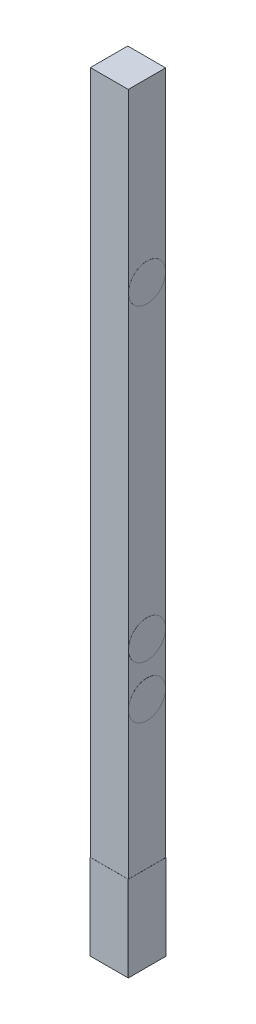
ISO-10303-21;
HEADER;
FILE_DESCRIPTION(('STEP AP214'),'2;1');
FILE_NAME('part.step','',(''),(''),'','','');
FILE_SCHEMA(('AUTOMOTIVE_DESIGN { 1 0 10303 214 1 1 1 1 }'));
ENDSEC;
DATA;
#1=APPLICATION_CONTEXT('core data for automotive mechanical design processes');
#2=APPLICATION_PROTOCOL_DEFINITION('international standard','automotive_design',2000,#1);
#3=PRODUCT_CONTEXT('',#1,'mechanical');
#4=PRODUCT('Part','Part','',(#3));
#5=PRODUCT_RELATED_PRODUCT_CATEGORY('part','',(#4));
#6=PRODUCT_DEFINITION_FORMATION('','',#4);
#7=PRODUCT_DEFINITION_CONTEXT('part definition',#1,'design');
#8=PRODUCT_DEFINITION('design','',#6,#7);
#9=PRODUCT_DEFINITION_SHAPE('','',#8);
#10=(LENGTH_UNIT() NAMED_UNIT(*) SI_UNIT(.MILLI.,.METRE.));
#11=(NAMED_UNIT(*) PLANE_ANGLE_UNIT() SI_UNIT($,.RADIAN.));
#12=(NAMED_UNIT(*) SI_UNIT($,.STERADIAN.) SOLID_ANGLE_UNIT());
#13=UNCERTAINTY_MEASURE_WITH_UNIT(LENGTH_MEASURE(1.E-05),#10,'distance_accuracy_value','');
#14=(GEOMETRIC_REPRESENTATION_CONTEXT(3) GLOBAL_UNCERTAINTY_ASSIGNED_CONTEXT((#13)) GLOBAL_UNIT_ASSIGNED_CONTEXT((#10,
#11,#12)) REPRESENTATION_CONTEXT('',''));
#15=CARTESIAN_POINT('',(0.,0.,0.));
#16=DIRECTION('',(0.,0.,1.));
#17=DIRECTION('',(1.,0.,0.));
#18=AXIS2_PLACEMENT_3D('',#15,#16,#17);
#19=CARTESIAN_POINT('',(-22.51,914.4,22.1884285714286));
#20=DIRECTION('',(0.,0.,-1.));
#21=DIRECTION('',(-1.,0.,0.));
#22=AXIS2_PLACEMENT_3D('',#19,#20,#21);
#23=PLANE('',#22);
#24=DIRECTION('',(-1.,0.,0.));
#25=VECTOR('',#24,1.);
#26=CARTESIAN_POINT('',(-22.61,101.6,22.1884285714286));
#27=LINE('',#26,#25);
#28=CARTESIAN_POINT('',(22.51,101.6,22.1884285714286));
#29=VERTEX_POINT('',#28);
#30=CARTESIAN_POINT('',(-22.51,101.6,22.1884285714286));
#31=VERTEX_POINT('',#30);
#32=EDGE_CURVE('E146',#29,#31,#27,.T.);
#33=ORIENTED_EDGE('',*,*,#32,.F.);
#34=DIRECTION('',(0.,-1.,0.));
#35=VECTOR('',#34,1.);
#36=CARTESIAN_POINT('',(22.51,914.4,22.1884285714286));
#37=LINE('',#36,#35);
#38=CARTESIAN_POINT('',(22.51,914.4,22.1884285714286));
#39=VERTEX_POINT('',#38);
#40=EDGE_CURVE('E226',#39,#29,#37,.T.);
#41=ORIENTED_EDGE('',*,*,#40,.F.);
#42=DIRECTION('',(1.,0.,0.));
#43=VECTOR('',#42,1.);
#44=CARTESIAN_POINT('',(-22.51,914.4,22.1884285714286));
#45=LINE('',#44,#43);
#46=CARTESIAN_POINT('',(-22.51,914.4,22.1884285714286));
#47=VERTEX_POINT('',#46);
#48=EDGE_CURVE('E223',#47,#39,#45,.T.);
#49=ORIENTED_EDGE('',*,*,#48,.F.);
#50=DIRECTION('',(0.,-1.,0.));
#51=VECTOR('',#50,1.);
#52=CARTESIAN_POINT('',(-22.51,914.4,22.1884285714286));
#53=LINE('',#52,#51);
#54=EDGE_CURVE('E232',#47,#31,#53,.T.);
#55=ORIENTED_EDGE('',*,*,#54,.T.);
#56=EDGE_LOOP('',(#33,#41,#49,#55));
#57=FACE_BOUND('',#56,.T.);
#58=ADVANCED_FACE('F41',(#57),#23,.F.);
#59=DIRECTION('',(0.,1.,0.));
#60=VECTOR('',#59,1.);
#61=CARTESIAN_POINT('',(22.51,0.,22.1884285714286));
#62=LINE('',#61,#60);
#63=CARTESIAN_POINT('',(22.51,0.,22.1884285714286));
#64=VERTEX_POINT('',#63);
#65=EDGE_CURVE('E57',#64,#29,#62,.T.);
#66=ORIENTED_EDGE('',*,*,#65,.F.);
#67=DIRECTION('',(1.,0.,0.));
#68=VECTOR('',#67,1.);
#69=CARTESIAN_POINT('',(-22.51,0.,22.1884285714286));
#70=LINE('',#69,#68);
#71=CARTESIAN_POINT('',(22.61,0.,22.1884285714286));
#72=VERTEX_POINT('',#71);
#73=EDGE_CURVE('E212',#64,#72,#70,.T.);
#74=ORIENTED_EDGE('',*,*,#73,.T.);
#75=DIRECTION('',(0.,-1.,0.));
#76=VECTOR('',#75,1.);
#77=CARTESIAN_POINT('',(22.61,0.,22.1884285714286));
#78=LINE('',#77,#76);
#79=CARTESIAN_POINT('',(22.61,101.6,22.1884285714286));
#80=VERTEX_POINT('',#79);
#81=EDGE_CURVE('E185',#80,#72,#78,.T.);
#82=ORIENTED_EDGE('',*,*,#81,.F.);
#83=DIRECTION('',(-1.,0.,0.));
#84=VECTOR('',#83,1.);
#85=CARTESIAN_POINT('',(22.61,101.6,22.1884285714286));
#86=LINE('',#85,#84);
#87=EDGE_CURVE('E195',#80,#29,#86,.T.);
#88=ORIENTED_EDGE('',*,*,#87,.T.);
#89=EDGE_LOOP('',(#66,#74,#82,#88));
#90=FACE_BOUND('',#89,.T.);
#91=ADVANCED_FACE('F283',(#90),#23,.F.);
#92=CARTESIAN_POINT('',(-22.51,914.4,22.1884285714286));
#93=DIRECTION('',(1.,0.,0.));
#94=DIRECTION('',(0.,0.,-1.));
#95=AXIS2_PLACEMENT_3D('',#92,#93,#94);
#96=PLANE('',#95);
#97=DIRECTION('',(0.,0.,-1.));
#98=VECTOR('',#97,1.);
#99=CARTESIAN_POINT('',(-22.51,101.6,-22.2884285714286));
#100=LINE('',#99,#98);
#101=CARTESIAN_POINT('',(-22.51,101.6,-22.1884285714286));
#102=VERTEX_POINT('',#101);
#103=EDGE_CURVE('E164',#31,#102,#100,.T.);
#104=ORIENTED_EDGE('',*,*,#103,.F.);
#105=ORIENTED_EDGE('',*,*,#54,.F.);
#106=DIRECTION('',(0.,0.,1.));
#107=VECTOR('',#106,1.);
#108=CARTESIAN_POINT('',(-22.51,914.4,22.1884285714286));
#109=LINE('',#108,#107);
#110=CARTESIAN_POINT('',(-22.51,914.4,-22.1884285714286));
#111=VERTEX_POINT('',#110);
#112=EDGE_CURVE('E220',#111,#47,#109,.T.);
#113=ORIENTED_EDGE('',*,*,#112,.F.);
#114=DIRECTION('',(0.,-1.,0.));
#115=VECTOR('',#114,1.);
#116=CARTESIAN_POINT('',(-22.51,914.4,-22.1884285714286));
#117=LINE('',#116,#115);
#118=EDGE_CURVE('E236',#111,#102,#117,.T.);
#119=ORIENTED_EDGE('',*,*,#118,.T.);
#120=EDGE_LOOP('',(#104,#105,#113,#119));
#121=FACE_BOUND('',#120,.T.);
#122=ADVANCED_FACE('F285',(#121),#96,.F.);
#123=CARTESIAN_POINT('',(-22.51,914.4,-22.1884285714286));
#124=DIRECTION('',(0.,0.,1.));
#125=DIRECTION('',(1.,0.,0.));
#126=AXIS2_PLACEMENT_3D('',#123,#124,#125);
#127=PLANE('',#126);
#128=DIRECTION('',(1.,0.,0.));
#129=VECTOR('',#128,1.);
#130=CARTESIAN_POINT('',(22.61,101.6,-22.1884285714286));
#131=LINE('',#130,#129);
#132=CARTESIAN_POINT('',(22.51,101.6,-22.1884285714286));
#133=VERTEX_POINT('',#132);
#134=EDGE_CURVE('E65',#102,#133,#131,.T.);
#135=ORIENTED_EDGE('',*,*,#134,.F.);
#136=ORIENTED_EDGE('',*,*,#118,.F.);
#137=DIRECTION('',(-1.,0.,0.));
#138=VECTOR('',#137,1.);
#139=CARTESIAN_POINT('',(-22.51,914.4,-22.1884285714286));
#140=LINE('',#139,#138);
#141=CARTESIAN_POINT('',(22.51,914.4,-22.1884285714286));
#142=VERTEX_POINT('',#141);
#143=EDGE_CURVE('E217',#142,#111,#140,.T.);
#144=ORIENTED_EDGE('',*,*,#143,.F.);
#145=DIRECTION('',(0.,-1.,0.));
#146=VECTOR('',#145,1.);
#147=CARTESIAN_POINT('',(22.51,914.4,-22.1884285714286));
#148=LINE('',#147,#146);
#149=EDGE_CURVE('E240',#142,#133,#148,.T.);
#150=ORIENTED_EDGE('',*,*,#149,.T.);
#151=EDGE_LOOP('',(#135,#136,#144,#150));
#152=FACE_BOUND('',#151,.T.);
#153=ADVANCED_FACE('F256',(#152),#127,.F.);
#154=CARTESIAN_POINT('',(22.51,914.4,22.1884285714286));
#155=DIRECTION('',(-1.,0.,0.));
#156=DIRECTION('',(0.,0.,1.));
#157=AXIS2_PLACEMENT_3D('',#154,#155,#156);
#158=PLANE('',#157);
#159=CARTESIAN_POINT('',(22.51,337.8,0.));
#160=DIRECTION('',(-1.,0.,0.));
#161=DIRECTION('',(0.,0.,1.));
#162=AXIS2_PLACEMENT_3D('',#159,#160,#161);
#163=CIRCLE('',#162,22.);
#164=CARTESIAN_POINT('',(22.51,337.8,22.));
#165=VERTEX_POINT('',#164);
#166=EDGE_CURVE('E244',#165,#165,#163,.F.);
#167=ORIENTED_EDGE('',*,*,#166,.F.);
#168=EDGE_LOOP('',(#167));
#169=FACE_BOUND('',#168,.T.);
#170=CARTESIAN_POINT('',(22.51,275.7,0.));
#171=DIRECTION('',(-1.,0.,0.));
#172=DIRECTION('',(0.,0.,1.));
#173=AXIS2_PLACEMENT_3D('',#170,#171,#172);
#174=CIRCLE('',#173,22.);
#175=CARTESIAN_POINT('',(22.51,275.7,22.));
#176=VERTEX_POINT('',#175);
#177=EDGE_CURVE('E50',#176,#176,#174,.F.);
#178=ORIENTED_EDGE('',*,*,#177,.F.);
#179=EDGE_LOOP('',(#178));
#180=FACE_BOUND('',#179,.T.);
#181=CARTESIAN_POINT('',(22.51,704.8,0.));
#182=DIRECTION('',(-1.,0.,0.));
#183=DIRECTION('',(0.,0.,1.));
#184=AXIS2_PLACEMENT_3D('',#181,#182,#183);
#185=CIRCLE('',#184,22.);
#186=CARTESIAN_POINT('',(22.51,704.8,22.));
#187=VERTEX_POINT('',#186);
#188=EDGE_CURVE('E11',#187,#187,#185,.F.);
#189=ORIENTED_EDGE('',*,*,#188,.F.);
#190=EDGE_LOOP('',(#189));
#191=FACE_BOUND('',#190,.T.);
#192=DIRECTION('',(0.,0.,1.));
#193=VECTOR('',#192,1.);
#194=CARTESIAN_POINT('',(22.51,101.6,22.1884285714286));
#195=LINE('',#194,#193);
#196=EDGE_CURVE('E182',#133,#29,#195,.T.);
#197=ORIENTED_EDGE('',*,*,#196,.F.);
#198=ORIENTED_EDGE('',*,*,#149,.F.);
#199=DIRECTION('',(0.,0.,-1.));
#200=VECTOR('',#199,1.);
#201=CARTESIAN_POINT('',(22.51,914.4,22.1884285714286));
#202=LINE('',#201,#200);
#203=EDGE_CURVE('E213',#39,#142,#202,.T.);
#204=ORIENTED_EDGE('',*,*,#203,.F.);
#205=ORIENTED_EDGE('',*,*,#40,.T.);
#206=EDGE_LOOP('',(#197,#198,#204,#205));
#207=FACE_BOUND('',#206,.T.);
#208=ADVANCED_FACE('F43',(#169,#180,#191,#207),#158,.F.);
#209=CARTESIAN_POINT('',(0.,914.4,0.));
#210=DIRECTION('',(0.,-1.,0.));
#211=DIRECTION('',(0.,0.,-1.));
#212=AXIS2_PLACEMENT_3D('',#209,#210,#211);
#213=PLANE('',#212);
#214=ORIENTED_EDGE('',*,*,#203,.T.);
#215=ORIENTED_EDGE('',*,*,#143,.T.);
#216=ORIENTED_EDGE('',*,*,#112,.T.);
#217=ORIENTED_EDGE('',*,*,#48,.T.);
#218=EDGE_LOOP('',(#214,#215,#216,#217));
#219=FACE_BOUND('',#218,.T.);
#220=ADVANCED_FACE('F255',(#219),#213,.F.);
#221=CARTESIAN_POINT('',(0.,0.,0.));
#222=DIRECTION('',(0.,-1.,0.));
#223=DIRECTION('',(0.,0.,-1.));
#224=AXIS2_PLACEMENT_3D('',#221,#222,#223);
#225=PLANE('',#224);
#226=ORIENTED_EDGE('',*,*,#73,.F.);
#227=DIRECTION('',(0.,0.,-1.));
#228=VECTOR('',#227,1.);
#229=CARTESIAN_POINT('',(22.51,0.,22.2884285714286));
#230=LINE('',#229,#228);
#231=CARTESIAN_POINT('',(22.51,0.,22.2884285714286));
#232=VERTEX_POINT('',#231);
#233=EDGE_CURVE('E135',#232,#64,#230,.T.);
#234=ORIENTED_EDGE('',*,*,#233,.F.);
#235=DIRECTION('',(1.,0.,0.));
#236=VECTOR('',#235,1.);
#237=CARTESIAN_POINT('',(-22.61,0.,22.2884285714286));
#238=LINE('',#237,#236);
#239=CARTESIAN_POINT('',(-22.61,0.,22.2884285714286));
#240=VERTEX_POINT('',#239);
#241=EDGE_CURVE('E132',#240,#232,#238,.T.);
#242=ORIENTED_EDGE('',*,*,#241,.F.);
#243=DIRECTION('',(0.,0.,1.));
#244=VECTOR('',#243,1.);
#245=CARTESIAN_POINT('',(-22.61,0.,-22.2884285714286));
#246=LINE('',#245,#244);
#247=CARTESIAN_POINT('',(-22.61,0.,-22.2884285714286));
#248=VERTEX_POINT('',#247);
#249=EDGE_CURVE('E118',#248,#240,#246,.T.);
#250=ORIENTED_EDGE('',*,*,#249,.F.);
#251=DIRECTION('',(-1.,0.,0.));
#252=VECTOR('',#251,1.);
#253=CARTESIAN_POINT('',(22.61,0.,-22.2884285714286));
#254=LINE('',#253,#252);
#255=CARTESIAN_POINT('',(22.61,0.,-22.2884285714286));
#256=VERTEX_POINT('',#255);
#257=EDGE_CURVE('E175',#256,#248,#254,.T.);
#258=ORIENTED_EDGE('',*,*,#257,.F.);
#259=DIRECTION('',(0.,0.,-1.));
#260=VECTOR('',#259,1.);
#261=CARTESIAN_POINT('',(22.61,0.,22.1884285714286));
#262=LINE('',#261,#260);
#263=EDGE_CURVE('E189',#72,#256,#262,.T.);
#264=ORIENTED_EDGE('',*,*,#263,.F.);
#265=EDGE_LOOP('',(#226,#234,#242,#250,#258,#264));
#266=FACE_BOUND('',#265,.T.);
#267=ADVANCED_FACE('F133',(#266),#225,.T.);
#268=CARTESIAN_POINT('',(22.61,337.8,0.));
#269=DIRECTION('',(-1.,0.,0.));
#270=DIRECTION('',(0.,0.,1.));
#271=AXIS2_PLACEMENT_3D('',#268,#269,#270);
#272=CYLINDRICAL_SURFACE('',#271,22.);
#273=CARTESIAN_POINT('',(22.61,337.8,0.));
#274=DIRECTION('',(1.,0.,0.));
#275=DIRECTION('',(0.,0.,-1.));
#276=AXIS2_PLACEMENT_3D('',#273,#274,#275);
#277=CIRCLE('',#276,22.);
#278=CARTESIAN_POINT('',(22.61,337.8,-22.));
#279=VERTEX_POINT('',#278);
#280=EDGE_CURVE('E208',#279,#279,#277,.T.);
#281=ORIENTED_EDGE('',*,*,#280,.F.);
#282=EDGE_LOOP('',(#281));
#283=FACE_BOUND('',#282,.T.);
#284=ORIENTED_EDGE('',*,*,#166,.T.);
#285=EDGE_LOOP('',(#284));
#286=FACE_BOUND('',#285,.T.);
#287=ADVANCED_FACE('F319',(#283,#286),#272,.T.);
#288=CARTESIAN_POINT('',(22.61,337.8,0.));
#289=DIRECTION('',(1.,0.,0.));
#290=DIRECTION('',(0.,0.,-1.));
#291=AXIS2_PLACEMENT_3D('',#288,#289,#290);
#292=PLANE('',#291);
#293=ORIENTED_EDGE('',*,*,#280,.T.);
#294=EDGE_LOOP('',(#293));
#295=FACE_BOUND('',#294,.T.);
#296=ADVANCED_FACE('F325',(#295),#292,.T.);
#297=CARTESIAN_POINT('',(22.61,275.7,0.));
#298=DIRECTION('',(-1.,0.,0.));
#299=DIRECTION('',(0.,0.,1.));
#300=AXIS2_PLACEMENT_3D('',#297,#298,#299);
#301=CYLINDRICAL_SURFACE('',#300,22.);
#302=CARTESIAN_POINT('',(22.61,275.7,0.));
#303=DIRECTION('',(1.,0.,0.));
#304=DIRECTION('',(0.,0.,-1.));
#305=AXIS2_PLACEMENT_3D('',#302,#303,#304);
#306=CIRCLE('',#305,22.);
#307=CARTESIAN_POINT('',(22.61,275.7,-22.));
#308=VERTEX_POINT('',#307);
#309=EDGE_CURVE('E204',#308,#308,#306,.T.);
#310=ORIENTED_EDGE('',*,*,#309,.F.);
#311=EDGE_LOOP('',(#310));
#312=FACE_BOUND('',#311,.T.);
#313=ORIENTED_EDGE('',*,*,#177,.T.);
#314=EDGE_LOOP('',(#313));
#315=FACE_BOUND('',#314,.T.);
#316=ADVANCED_FACE('F251',(#312,#315),#301,.T.);
#317=CARTESIAN_POINT('',(22.61,275.7,0.));
#318=DIRECTION('',(1.,0.,0.));
#319=DIRECTION('',(0.,0.,-1.));
#320=AXIS2_PLACEMENT_3D('',#317,#318,#319);
#321=PLANE('',#320);
#322=ORIENTED_EDGE('',*,*,#309,.T.);
#323=EDGE_LOOP('',(#322));
#324=FACE_BOUND('',#323,.T.);
#325=ADVANCED_FACE('F340',(#324),#321,.T.);
#326=CARTESIAN_POINT('',(22.61,704.8,0.));
#327=DIRECTION('',(-1.,0.,0.));
#328=DIRECTION('',(0.,0.,1.));
#329=AXIS2_PLACEMENT_3D('',#326,#327,#328);
#330=CYLINDRICAL_SURFACE('',#329,22.);
#331=CARTESIAN_POINT('',(22.61,704.8,0.));
#332=DIRECTION('',(1.,0.,0.));
#333=DIRECTION('',(0.,0.,-1.));
#334=AXIS2_PLACEMENT_3D('',#331,#332,#333);
#335=CIRCLE('',#334,22.);
#336=CARTESIAN_POINT('',(22.61,704.8,-22.));
#337=VERTEX_POINT('',#336);
#338=EDGE_CURVE('E200',#337,#337,#335,.T.);
#339=ORIENTED_EDGE('',*,*,#338,.F.);
#340=EDGE_LOOP('',(#339));
#341=FACE_BOUND('',#340,.T.);
#342=ORIENTED_EDGE('',*,*,#188,.T.);
#343=EDGE_LOOP('',(#342));
#344=FACE_BOUND('',#343,.T.);
#345=ADVANCED_FACE('F348',(#341,#344),#330,.T.);
#346=CARTESIAN_POINT('',(22.61,704.8,0.));
#347=DIRECTION('',(1.,0.,0.));
#348=DIRECTION('',(0.,0.,-1.));
#349=AXIS2_PLACEMENT_3D('',#346,#347,#348);
#350=PLANE('',#349);
#351=ORIENTED_EDGE('',*,*,#338,.T.);
#352=EDGE_LOOP('',(#351));
#353=FACE_BOUND('',#352,.T.);
#354=ADVANCED_FACE('F356',(#353),#350,.T.);
#355=CARTESIAN_POINT('',(22.61,101.6,22.1884285714286));
#356=DIRECTION('',(0.,-1.,0.));
#357=DIRECTION('',(0.,0.,-1.));
#358=AXIS2_PLACEMENT_3D('',#355,#356,#357);
#359=PLANE('',#358);
#360=ORIENTED_EDGE('',*,*,#196,.T.);
#361=ORIENTED_EDGE('',*,*,#87,.F.);
#362=DIRECTION('',(0.,0.,1.));
#363=VECTOR('',#362,1.);
#364=CARTESIAN_POINT('',(22.61,101.6,22.1884285714286));
#365=LINE('',#364,#363);
#366=CARTESIAN_POINT('',(22.61,101.6,-22.2884285714286));
#367=VERTEX_POINT('',#366);
#368=EDGE_CURVE('E192',#367,#80,#365,.T.);
#369=ORIENTED_EDGE('',*,*,#368,.F.);
#370=DIRECTION('',(1.,0.,0.));
#371=VECTOR('',#370,1.);
#372=CARTESIAN_POINT('',(22.61,101.6,-22.2884285714286));
#373=LINE('',#372,#371);
#374=CARTESIAN_POINT('',(-22.61,101.6,-22.2884285714286));
#375=VERTEX_POINT('',#374);
#376=EDGE_CURVE('E178',#375,#367,#373,.T.);
#377=ORIENTED_EDGE('',*,*,#376,.F.);
#378=DIRECTION('',(0.,0.,-1.));
#379=VECTOR('',#378,1.);
#380=CARTESIAN_POINT('',(-22.61,101.6,-22.2884285714286));
#381=LINE('',#380,#379);
#382=CARTESIAN_POINT('',(-22.61,101.6,22.2884285714286));
#383=VERTEX_POINT('',#382);
#384=EDGE_CURVE('E129',#383,#375,#381,.T.);
#385=ORIENTED_EDGE('',*,*,#384,.F.);
#386=DIRECTION('',(-1.,0.,0.));
#387=VECTOR('',#386,1.);
#388=CARTESIAN_POINT('',(-22.61,101.6,22.2884285714286));
#389=LINE('',#388,#387);
#390=CARTESIAN_POINT('',(22.51,101.6,22.2884285714286));
#391=VERTEX_POINT('',#390);
#392=EDGE_CURVE('E144',#391,#383,#389,.T.);
#393=ORIENTED_EDGE('',*,*,#392,.F.);
#394=DIRECTION('',(0.,0.,-1.));
#395=VECTOR('',#394,1.);
#396=CARTESIAN_POINT('',(22.51,101.6,22.2884285714286));
#397=LINE('',#396,#395);
#398=EDGE_CURVE('E156',#391,#29,#397,.T.);
#399=ORIENTED_EDGE('',*,*,#398,.T.);
#400=ORIENTED_EDGE('',*,*,#32,.T.);
#401=ORIENTED_EDGE('',*,*,#103,.T.);
#402=ORIENTED_EDGE('',*,*,#134,.T.);
#403=EDGE_LOOP('',(#360,#361,#369,#377,#385,#393,#399,#400,#401,#402));
#404=FACE_BOUND('',#403,.T.);
#405=ADVANCED_FACE('F275',(#404),#359,.F.);
#406=CARTESIAN_POINT('',(22.61,0.,0.));
#407=DIRECTION('',(-1.,0.,0.));
#408=DIRECTION('',(0.,0.,1.));
#409=AXIS2_PLACEMENT_3D('',#406,#407,#408);
#410=PLANE('',#409);
#411=ORIENTED_EDGE('',*,*,#81,.T.);
#412=ORIENTED_EDGE('',*,*,#263,.T.);
#413=DIRECTION('',(0.,-1.,0.));
#414=VECTOR('',#413,1.);
#415=CARTESIAN_POINT('',(22.61,0.,-22.2884285714286));
#416=LINE('',#415,#414);
#417=EDGE_CURVE('E171',#367,#256,#416,.T.);
#418=ORIENTED_EDGE('',*,*,#417,.F.);
#419=ORIENTED_EDGE('',*,*,#368,.T.);
#420=EDGE_LOOP('',(#411,#412,#418,#419));
#421=FACE_BOUND('',#420,.T.);
#422=ADVANCED_FACE('F282',(#421),#410,.F.);
#423=CARTESIAN_POINT('',(0.,0.,-22.2884285714286));
#424=DIRECTION('',(0.,0.,1.));
#425=DIRECTION('',(1.,0.,0.));
#426=AXIS2_PLACEMENT_3D('',#423,#424,#425);
#427=PLANE('',#426);
#428=ORIENTED_EDGE('',*,*,#417,.T.);
#429=ORIENTED_EDGE('',*,*,#257,.T.);
#430=DIRECTION('',(0.,-1.,0.));
#431=VECTOR('',#430,1.);
#432=CARTESIAN_POINT('',(-22.61,0.,-22.2884285714286));
#433=LINE('',#432,#431);
#434=EDGE_CURVE('E125',#375,#248,#433,.T.);
#435=ORIENTED_EDGE('',*,*,#434,.F.);
#436=ORIENTED_EDGE('',*,*,#376,.T.);
#437=EDGE_LOOP('',(#428,#429,#435,#436));
#438=FACE_BOUND('',#437,.T.);
#439=ADVANCED_FACE('F277',(#438),#427,.F.);
#440=CARTESIAN_POINT('',(-22.61,0.,0.));
#441=DIRECTION('',(1.,0.,0.));
#442=DIRECTION('',(0.,0.,-1.));
#443=AXIS2_PLACEMENT_3D('',#440,#441,#442);
#444=PLANE('',#443);
#445=ORIENTED_EDGE('',*,*,#434,.T.);
#446=ORIENTED_EDGE('',*,*,#249,.T.);
#447=DIRECTION('',(0.,-1.,0.));
#448=VECTOR('',#447,1.);
#449=CARTESIAN_POINT('',(-22.61,0.,22.2884285714286));
#450=LINE('',#449,#448);
#451=EDGE_CURVE('E123',#383,#240,#450,.T.);
#452=ORIENTED_EDGE('',*,*,#451,.F.);
#453=ORIENTED_EDGE('',*,*,#384,.T.);
#454=EDGE_LOOP('',(#445,#446,#452,#453));
#455=FACE_BOUND('',#454,.T.);
#456=ADVANCED_FACE('F120',(#455),#444,.F.);
#457=CARTESIAN_POINT('',(22.51,0.,22.2884285714286));
#458=DIRECTION('',(-1.,0.,0.));
#459=DIRECTION('',(0.,0.,1.));
#460=AXIS2_PLACEMENT_3D('',#457,#458,#459);
#461=PLANE('',#460);
#462=ORIENTED_EDGE('',*,*,#65,.T.);
#463=ORIENTED_EDGE('',*,*,#398,.F.);
#464=DIRECTION('',(0.,1.,0.));
#465=VECTOR('',#464,1.);
#466=CARTESIAN_POINT('',(22.51,0.,22.2884285714286));
#467=LINE('',#466,#465);
#468=EDGE_CURVE('E139',#232,#391,#467,.T.);
#469=ORIENTED_EDGE('',*,*,#468,.F.);
#470=ORIENTED_EDGE('',*,*,#233,.T.);
#471=EDGE_LOOP('',(#462,#463,#469,#470));
#472=FACE_BOUND('',#471,.T.);
#473=ADVANCED_FACE('F274',(#472),#461,.F.);
#474=CARTESIAN_POINT('',(0.,0.,22.2884285714286));
#475=DIRECTION('',(0.,0.,-1.));
#476=DIRECTION('',(-1.,0.,0.));
#477=AXIS2_PLACEMENT_3D('',#474,#475,#476);
#478=PLANE('',#477);
#479=ORIENTED_EDGE('',*,*,#451,.T.);
#480=ORIENTED_EDGE('',*,*,#241,.T.);
#481=ORIENTED_EDGE('',*,*,#468,.T.);
#482=ORIENTED_EDGE('',*,*,#392,.T.);
#483=EDGE_LOOP('',(#479,#480,#481,#482));
#484=FACE_BOUND('',#483,.T.);
#485=ADVANCED_FACE('F142',(#484),#478,.F.);
#486=CLOSED_SHELL('',(#58,#91,#122,#153,#208,#220,#267,#287,#296,#316,#325,#345,#354,#405,#422,
#439,#456,#473,#485));
#487=MANIFOLD_SOLID_BREP('B2',#486);
#488=ADVANCED_BREP_SHAPE_REPRESENTATION('',(#18,#487),#14);
#489=SHAPE_DEFINITION_REPRESENTATION(#9,#488);
ENDSEC;
END-ISO-10303-21;
